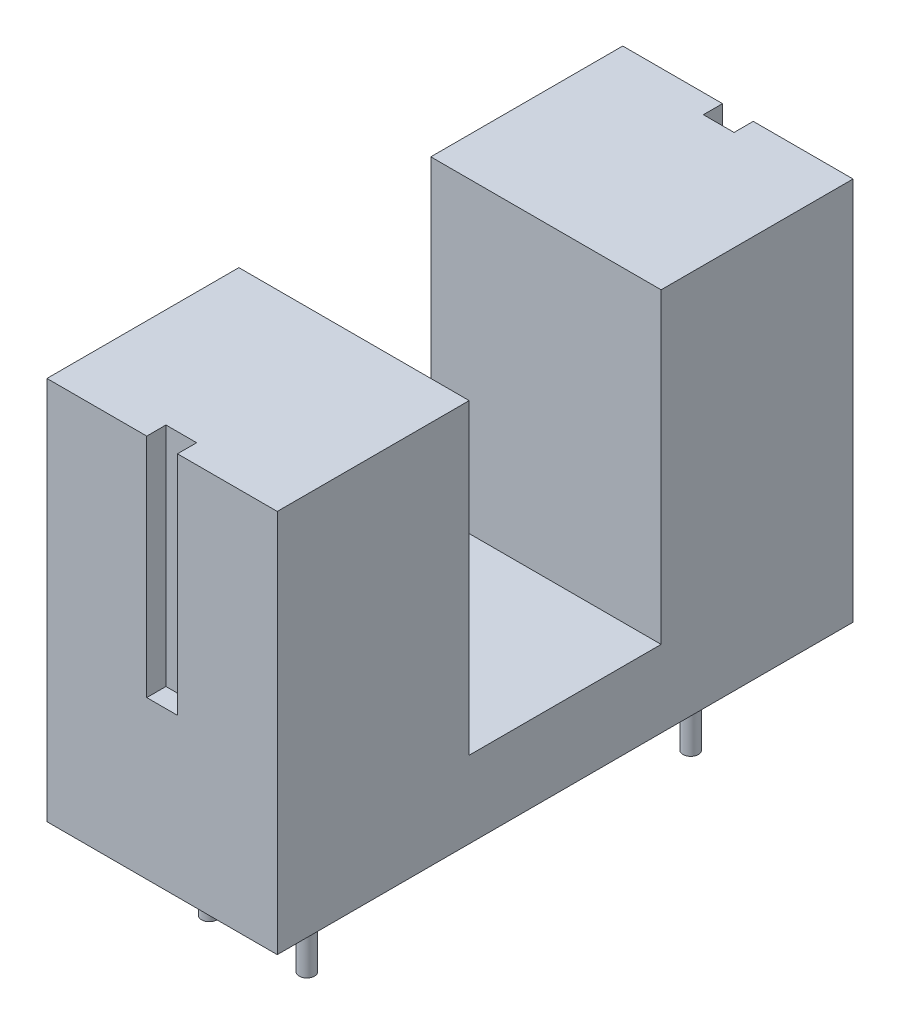
ISO-10303-21;
HEADER;
FILE_DESCRIPTION(('STEP AP214'),'2;1');
FILE_NAME('part.step','',(''),(''),'','','');
FILE_SCHEMA(('AUTOMOTIVE_DESIGN { 1 0 10303 214 1 1 1 1 }'));
ENDSEC;
DATA;
#1=APPLICATION_CONTEXT('core data for automotive mechanical design processes');
#2=APPLICATION_PROTOCOL_DEFINITION('international standard','automotive_design',2000,#1);
#3=PRODUCT_CONTEXT('',#1,'mechanical');
#4=PRODUCT('Part','Part','',(#3));
#5=PRODUCT_RELATED_PRODUCT_CATEGORY('part','',(#4));
#6=PRODUCT_DEFINITION_FORMATION('','',#4);
#7=PRODUCT_DEFINITION_CONTEXT('part definition',#1,'design');
#8=PRODUCT_DEFINITION('design','',#6,#7);
#9=PRODUCT_DEFINITION_SHAPE('','',#8);
#10=(LENGTH_UNIT() NAMED_UNIT(*) SI_UNIT(.MILLI.,.METRE.));
#11=(NAMED_UNIT(*) PLANE_ANGLE_UNIT() SI_UNIT($,.RADIAN.));
#12=(NAMED_UNIT(*) SI_UNIT($,.STERADIAN.) SOLID_ANGLE_UNIT());
#13=UNCERTAINTY_MEASURE_WITH_UNIT(LENGTH_MEASURE(1.E-05),#10,'distance_accuracy_value','');
#14=(GEOMETRIC_REPRESENTATION_CONTEXT(3) GLOBAL_UNCERTAINTY_ASSIGNED_CONTEXT((#13)) GLOBAL_UNIT_ASSIGNED_CONTEXT((#10,
#11,#12)) REPRESENTATION_CONTEXT('',''));
#15=CARTESIAN_POINT('',(0.,0.,0.));
#16=DIRECTION('',(0.,0.,1.));
#17=DIRECTION('',(1.,0.,0.));
#18=AXIS2_PLACEMENT_3D('',#15,#16,#17);
#19=CARTESIAN_POINT('',(6.,3.2,7.49999999999999));
#20=DIRECTION('',(0.,-1.,0.));
#21=DIRECTION('',(0.,0.,-1.));
#22=AXIS2_PLACEMENT_3D('',#19,#20,#21);
#23=PLANE('',#22);
#24=DIRECTION('',(0.,0.,1.));
#25=VECTOR('',#24,1.);
#26=CARTESIAN_POINT('',(3.4,3.2,7.00000000000002));
#27=LINE('',#26,#25);
#28=CARTESIAN_POINT('',(3.4,3.2,7.00000000000002));
#29=VERTEX_POINT('',#28);
#30=CARTESIAN_POINT('',(3.4,3.2,7.50000000000002));
#31=VERTEX_POINT('',#30);
#32=EDGE_CURVE('E153',#29,#31,#27,.T.);
#33=ORIENTED_EDGE('',*,*,#32,.T.);
#34=DIRECTION('',(-1.,0.,0.));
#35=VECTOR('',#34,1.);
#36=CARTESIAN_POINT('',(6.,3.2,7.49999999999999));
#37=LINE('',#36,#35);
#38=CARTESIAN_POINT('',(6.,3.2,7.49999999999999));
#39=VERTEX_POINT('',#38);
#40=EDGE_CURVE('E257',#39,#31,#37,.T.);
#41=ORIENTED_EDGE('',*,*,#40,.F.);
#42=DIRECTION('',(0.,0.,1.));
#43=VECTOR('',#42,1.);
#44=CARTESIAN_POINT('',(6.,3.2,7.49999999999999));
#45=LINE('',#44,#43);
#46=CARTESIAN_POINT('',(6.,3.2,2.49999999999999));
#47=VERTEX_POINT('',#46);
#48=EDGE_CURVE('E232',#47,#39,#45,.T.);
#49=ORIENTED_EDGE('',*,*,#48,.F.);
#50=DIRECTION('',(-1.,0.,0.));
#51=VECTOR('',#50,1.);
#52=CARTESIAN_POINT('',(6.,3.2,2.49999999999999));
#53=LINE('',#52,#51);
#54=CARTESIAN_POINT('',(0.,3.2,2.49999999999999));
#55=VERTEX_POINT('',#54);
#56=EDGE_CURVE('E259',#47,#55,#53,.T.);
#57=ORIENTED_EDGE('',*,*,#56,.T.);
#58=DIRECTION('',(0.,0.,1.));
#59=VECTOR('',#58,1.);
#60=CARTESIAN_POINT('',(0.,3.2,7.49999999999999));
#61=LINE('',#60,#59);
#62=CARTESIAN_POINT('',(0.,3.2,7.49999999999999));
#63=VERTEX_POINT('',#62);
#64=EDGE_CURVE('E250',#55,#63,#61,.T.);
#65=ORIENTED_EDGE('',*,*,#64,.T.);
#66=CARTESIAN_POINT('',(2.6,3.2,7.49999999999999));
#67=VERTEX_POINT('',#66);
#68=EDGE_CURVE('E256',#67,#63,#37,.T.);
#69=ORIENTED_EDGE('',*,*,#68,.F.);
#70=DIRECTION('',(0.,0.,1.));
#71=VECTOR('',#70,1.);
#72=CARTESIAN_POINT('',(2.6,3.2,7.00000000000002));
#73=LINE('',#72,#71);
#74=CARTESIAN_POINT('',(2.6,3.2,7.00000000000002));
#75=VERTEX_POINT('',#74);
#76=EDGE_CURVE('E52',#75,#67,#73,.T.);
#77=ORIENTED_EDGE('',*,*,#76,.F.);
#78=DIRECTION('',(1.,0.,0.));
#79=VECTOR('',#78,1.);
#80=CARTESIAN_POINT('',(3.4,3.2,7.00000000000002));
#81=LINE('',#80,#79);
#82=EDGE_CURVE('E171',#75,#29,#81,.T.);
#83=ORIENTED_EDGE('',*,*,#82,.T.);
#84=EDGE_LOOP('',(#33,#41,#49,#57,#65,#69,#77,#83));
#85=FACE_BOUND('',#84,.T.);
#86=ADVANCED_FACE('F37',(#85),#23,.F.);
#87=CARTESIAN_POINT('',(6.,-6.8,7.49999999999999));
#88=DIRECTION('',(0.,0.,-1.));
#89=DIRECTION('',(-1.,0.,0.));
#90=AXIS2_PLACEMENT_3D('',#87,#88,#89);
#91=PLANE('',#90);
#92=DIRECTION('',(0.,-1.,0.));
#93=VECTOR('',#92,1.);
#94=CARTESIAN_POINT('',(3.4,3.2,7.50000000000002));
#95=LINE('',#94,#93);
#96=CARTESIAN_POINT('',(3.4,-2.7,7.50000000000002));
#97=VERTEX_POINT('',#96);
#98=EDGE_CURVE('E160',#31,#97,#95,.T.);
#99=ORIENTED_EDGE('',*,*,#98,.T.);
#100=DIRECTION('',(-1.,0.,0.));
#101=VECTOR('',#100,1.);
#102=CARTESIAN_POINT('',(3.4,-2.7,7.50000000000002));
#103=LINE('',#102,#101);
#104=CARTESIAN_POINT('',(2.6,-2.7,7.50000000000002));
#105=VERTEX_POINT('',#104);
#106=EDGE_CURVE('E172',#97,#105,#103,.T.);
#107=ORIENTED_EDGE('',*,*,#106,.T.);
#108=DIRECTION('',(0.,1.,0.));
#109=VECTOR('',#108,1.);
#110=CARTESIAN_POINT('',(2.6,3.2,7.50000000000002));
#111=LINE('',#110,#109);
#112=EDGE_CURVE('E182',#105,#67,#111,.T.);
#113=ORIENTED_EDGE('',*,*,#112,.T.);
#114=ORIENTED_EDGE('',*,*,#68,.T.);
#115=DIRECTION('',(0.,-1.,0.));
#116=VECTOR('',#115,1.);
#117=CARTESIAN_POINT('',(0.,-6.8,7.49999999999999));
#118=LINE('',#117,#116);
#119=CARTESIAN_POINT('',(0.,-6.8,7.49999999999999));
#120=VERTEX_POINT('',#119);
#121=EDGE_CURVE('E222',#63,#120,#118,.T.);
#122=ORIENTED_EDGE('',*,*,#121,.T.);
#123=DIRECTION('',(-1.,0.,0.));
#124=VECTOR('',#123,1.);
#125=CARTESIAN_POINT('',(6.,-6.8,7.49999999999999));
#126=LINE('',#125,#124);
#127=CARTESIAN_POINT('',(6.,-6.8,7.49999999999999));
#128=VERTEX_POINT('',#127);
#129=EDGE_CURVE('E236',#128,#120,#126,.T.);
#130=ORIENTED_EDGE('',*,*,#129,.F.);
#131=DIRECTION('',(0.,-1.,0.));
#132=VECTOR('',#131,1.);
#133=CARTESIAN_POINT('',(6.,-6.8,7.49999999999999));
#134=LINE('',#133,#132);
#135=EDGE_CURVE('E234',#39,#128,#134,.T.);
#136=ORIENTED_EDGE('',*,*,#135,.F.);
#137=ORIENTED_EDGE('',*,*,#40,.T.);
#138=EDGE_LOOP('',(#99,#107,#113,#114,#122,#130,#136,#137));
#139=FACE_BOUND('',#138,.T.);
#140=ADVANCED_FACE('F291',(#139),#91,.F.);
#141=CARTESIAN_POINT('',(6.,-6.8,-7.50000000000002));
#142=DIRECTION('',(0.,1.,0.));
#143=DIRECTION('',(0.,0.,1.));
#144=AXIS2_PLACEMENT_3D('',#141,#142,#143);
#145=PLANE('',#144);
#146=CARTESIAN_POINT('',(1.73,-6.8,5.));
#147=DIRECTION('',(0.,1.,0.));
#148=DIRECTION('',(0.,0.,1.));
#149=AXIS2_PLACEMENT_3D('',#146,#147,#148);
#150=CIRCLE('',#149,0.2);
#151=CARTESIAN_POINT('',(1.73,-6.8,5.2));
#152=VERTEX_POINT('',#151);
#153=EDGE_CURVE('E11',#152,#152,#150,.F.);
#154=ORIENTED_EDGE('',*,*,#153,.F.);
#155=EDGE_LOOP('',(#154));
#156=FACE_BOUND('',#155,.T.);
#157=CARTESIAN_POINT('',(4.27,-6.8,5.));
#158=DIRECTION('',(0.,1.,0.));
#159=DIRECTION('',(0.,0.,1.));
#160=AXIS2_PLACEMENT_3D('',#157,#158,#159);
#161=CIRCLE('',#160,0.2);
#162=CARTESIAN_POINT('',(4.27,-6.8,5.2));
#163=VERTEX_POINT('',#162);
#164=EDGE_CURVE('E45',#163,#163,#161,.F.);
#165=ORIENTED_EDGE('',*,*,#164,.F.);
#166=EDGE_LOOP('',(#165));
#167=FACE_BOUND('',#166,.T.);
#168=CARTESIAN_POINT('',(4.27,-6.8,-5.));
#169=DIRECTION('',(0.,1.,0.));
#170=DIRECTION('',(0.,0.,1.));
#171=AXIS2_PLACEMENT_3D('',#168,#169,#170);
#172=CIRCLE('',#171,0.2);
#173=CARTESIAN_POINT('',(4.27,-6.8,-4.8));
#174=VERTEX_POINT('',#173);
#175=EDGE_CURVE('E281',#174,#174,#172,.F.);
#176=ORIENTED_EDGE('',*,*,#175,.F.);
#177=EDGE_LOOP('',(#176));
#178=FACE_BOUND('',#177,.T.);
#179=CARTESIAN_POINT('',(1.73,-6.8,-5.));
#180=DIRECTION('',(0.,1.,0.));
#181=DIRECTION('',(0.,0.,1.));
#182=AXIS2_PLACEMENT_3D('',#179,#180,#181);
#183=CIRCLE('',#182,0.2);
#184=CARTESIAN_POINT('',(1.73,-6.8,-4.8));
#185=VERTEX_POINT('',#184);
#186=EDGE_CURVE('E278',#185,#185,#183,.F.);
#187=ORIENTED_EDGE('',*,*,#186,.F.);
#188=EDGE_LOOP('',(#187));
#189=FACE_BOUND('',#188,.T.);
#190=DIRECTION('',(0.,0.,-1.));
#191=VECTOR('',#190,1.);
#192=CARTESIAN_POINT('',(0.,-6.8,-7.50000000000002));
#193=LINE('',#192,#191);
#194=CARTESIAN_POINT('',(0.,-6.8,-7.50000000000002));
#195=VERTEX_POINT('',#194);
#196=EDGE_CURVE('E211',#120,#195,#193,.T.);
#197=ORIENTED_EDGE('',*,*,#196,.T.);
#198=DIRECTION('',(-1.,0.,0.));
#199=VECTOR('',#198,1.);
#200=CARTESIAN_POINT('',(6.,-6.8,-7.50000000000002));
#201=LINE('',#200,#199);
#202=CARTESIAN_POINT('',(6.,-6.8,-7.50000000000002));
#203=VERTEX_POINT('',#202);
#204=EDGE_CURVE('E275',#203,#195,#201,.T.);
#205=ORIENTED_EDGE('',*,*,#204,.F.);
#206=DIRECTION('',(0.,0.,-1.));
#207=VECTOR('',#206,1.);
#208=CARTESIAN_POINT('',(6.,-6.8,-7.50000000000002));
#209=LINE('',#208,#207);
#210=EDGE_CURVE('E218',#128,#203,#209,.T.);
#211=ORIENTED_EDGE('',*,*,#210,.F.);
#212=ORIENTED_EDGE('',*,*,#129,.T.);
#213=EDGE_LOOP('',(#197,#205,#211,#212));
#214=FACE_BOUND('',#213,.T.);
#215=ADVANCED_FACE('F39',(#156,#167,#178,#189,#214),#145,.F.);
#216=CARTESIAN_POINT('',(6.,-6.8,-7.50000000000002));
#217=DIRECTION('',(0.,0.,1.));
#218=DIRECTION('',(1.,0.,0.));
#219=AXIS2_PLACEMENT_3D('',#216,#217,#218);
#220=PLANE('',#219);
#221=DIRECTION('',(-1.,0.,0.));
#222=VECTOR('',#221,1.);
#223=CARTESIAN_POINT('',(3.4,-2.7,-7.50000000000002));
#224=LINE('',#223,#222);
#225=CARTESIAN_POINT('',(3.4,-2.7,-7.50000000000002));
#226=VERTEX_POINT('',#225);
#227=CARTESIAN_POINT('',(2.6,-2.7,-7.50000000000002));
#228=VERTEX_POINT('',#227);
#229=EDGE_CURVE('E205',#226,#228,#224,.T.);
#230=ORIENTED_EDGE('',*,*,#229,.F.);
#231=DIRECTION('',(0.,-1.,0.));
#232=VECTOR('',#231,1.);
#233=CARTESIAN_POINT('',(3.4,3.2,-7.50000000000002));
#234=LINE('',#233,#232);
#235=CARTESIAN_POINT('',(3.4,3.2,-7.50000000000002));
#236=VERTEX_POINT('',#235);
#237=EDGE_CURVE('E189',#236,#226,#234,.T.);
#238=ORIENTED_EDGE('',*,*,#237,.F.);
#239=DIRECTION('',(-1.,0.,0.));
#240=VECTOR('',#239,1.);
#241=CARTESIAN_POINT('',(6.,3.2,-7.50000000000002));
#242=LINE('',#241,#240);
#243=CARTESIAN_POINT('',(6.,3.2,-7.50000000000002));
#244=VERTEX_POINT('',#243);
#245=EDGE_CURVE('E272',#244,#236,#242,.T.);
#246=ORIENTED_EDGE('',*,*,#245,.F.);
#247=DIRECTION('',(0.,1.,0.));
#248=VECTOR('',#247,1.);
#249=CARTESIAN_POINT('',(6.,-6.8,-7.50000000000002));
#250=LINE('',#249,#248);
#251=EDGE_CURVE('E221',#203,#244,#250,.T.);
#252=ORIENTED_EDGE('',*,*,#251,.F.);
#253=ORIENTED_EDGE('',*,*,#204,.T.);
#254=DIRECTION('',(0.,1.,0.));
#255=VECTOR('',#254,1.);
#256=CARTESIAN_POINT('',(0.,-6.8,-7.50000000000002));
#257=LINE('',#256,#255);
#258=CARTESIAN_POINT('',(0.,3.2,-7.50000000000002));
#259=VERTEX_POINT('',#258);
#260=EDGE_CURVE('E239',#195,#259,#257,.T.);
#261=ORIENTED_EDGE('',*,*,#260,.T.);
#262=CARTESIAN_POINT('',(2.6,3.2,-7.50000000000002));
#263=VERTEX_POINT('',#262);
#264=EDGE_CURVE('E271',#263,#259,#242,.T.);
#265=ORIENTED_EDGE('',*,*,#264,.F.);
#266=DIRECTION('',(0.,1.,0.));
#267=VECTOR('',#266,1.);
#268=CARTESIAN_POINT('',(2.6,3.2,-7.50000000000002));
#269=LINE('',#268,#267);
#270=EDGE_CURVE('E197',#228,#263,#269,.T.);
#271=ORIENTED_EDGE('',*,*,#270,.F.);
#272=EDGE_LOOP('',(#230,#238,#246,#252,#253,#261,#265,#271));
#273=FACE_BOUND('',#272,.T.);
#274=ADVANCED_FACE('F290',(#273),#220,.F.);
#275=CARTESIAN_POINT('',(6.,3.2,-7.50000000000002));
#276=DIRECTION('',(0.,-1.,0.));
#277=DIRECTION('',(0.,0.,-1.));
#278=AXIS2_PLACEMENT_3D('',#275,#276,#277);
#279=PLANE('',#278);
#280=ORIENTED_EDGE('',*,*,#245,.T.);
#281=DIRECTION('',(0.,0.,-1.));
#282=VECTOR('',#281,1.);
#283=CARTESIAN_POINT('',(3.4,3.2,-7.00000000000002));
#284=LINE('',#283,#282);
#285=CARTESIAN_POINT('',(3.4,3.2,-7.00000000000002));
#286=VERTEX_POINT('',#285);
#287=EDGE_CURVE('E209',#286,#236,#284,.T.);
#288=ORIENTED_EDGE('',*,*,#287,.F.);
#289=DIRECTION('',(1.,0.,0.));
#290=VECTOR('',#289,1.);
#291=CARTESIAN_POINT('',(3.4,3.2,-7.00000000000002));
#292=LINE('',#291,#290);
#293=CARTESIAN_POINT('',(2.6,3.2,-7.00000000000002));
#294=VERTEX_POINT('',#293);
#295=EDGE_CURVE('E200',#294,#286,#292,.T.);
#296=ORIENTED_EDGE('',*,*,#295,.F.);
#297=DIRECTION('',(0.,0.,-1.));
#298=VECTOR('',#297,1.);
#299=CARTESIAN_POINT('',(2.6,3.2,-7.00000000000002));
#300=LINE('',#299,#298);
#301=EDGE_CURVE('E212',#294,#263,#300,.T.);
#302=ORIENTED_EDGE('',*,*,#301,.T.);
#303=ORIENTED_EDGE('',*,*,#264,.T.);
#304=DIRECTION('',(0.,0.,1.));
#305=VECTOR('',#304,1.);
#306=CARTESIAN_POINT('',(0.,3.2,-7.50000000000002));
#307=LINE('',#306,#305);
#308=CARTESIAN_POINT('',(0.,3.2,-2.50000000000002));
#309=VERTEX_POINT('',#308);
#310=EDGE_CURVE('E242',#259,#309,#307,.T.);
#311=ORIENTED_EDGE('',*,*,#310,.T.);
#312=DIRECTION('',(-1.,0.,0.));
#313=VECTOR('',#312,1.);
#314=CARTESIAN_POINT('',(6.,3.2,-2.50000000000002));
#315=LINE('',#314,#313);
#316=CARTESIAN_POINT('',(6.,3.2,-2.50000000000002));
#317=VERTEX_POINT('',#316);
#318=EDGE_CURVE('E268',#317,#309,#315,.T.);
#319=ORIENTED_EDGE('',*,*,#318,.F.);
#320=DIRECTION('',(0.,0.,1.));
#321=VECTOR('',#320,1.);
#322=CARTESIAN_POINT('',(6.,3.2,-7.50000000000002));
#323=LINE('',#322,#321);
#324=EDGE_CURVE('E224',#244,#317,#323,.T.);
#325=ORIENTED_EDGE('',*,*,#324,.F.);
#326=EDGE_LOOP('',(#280,#288,#296,#302,#303,#311,#319,#325));
#327=FACE_BOUND('',#326,.T.);
#328=ADVANCED_FACE('F334',(#327),#279,.F.);
#329=CARTESIAN_POINT('',(6.,3.2,-2.50000000000002));
#330=DIRECTION('',(0.,0.,-1.));
#331=DIRECTION('',(0.,1.,0.));
#332=AXIS2_PLACEMENT_3D('',#329,#330,#331);
#333=PLANE('',#332);
#334=DIRECTION('',(0.,-1.,0.));
#335=VECTOR('',#334,1.);
#336=CARTESIAN_POINT('',(0.,3.2,-2.50000000000002));
#337=LINE('',#336,#335);
#338=CARTESIAN_POINT('',(0.,-4.8,-2.50000000000001));
#339=VERTEX_POINT('',#338);
#340=EDGE_CURVE('E244',#309,#339,#337,.T.);
#341=ORIENTED_EDGE('',*,*,#340,.T.);
#342=DIRECTION('',(-1.,0.,0.));
#343=VECTOR('',#342,1.);
#344=CARTESIAN_POINT('',(6.,-4.8,-2.50000000000001));
#345=LINE('',#344,#343);
#346=CARTESIAN_POINT('',(6.,-4.8,-2.50000000000001));
#347=VERTEX_POINT('',#346);
#348=EDGE_CURVE('E265',#347,#339,#345,.T.);
#349=ORIENTED_EDGE('',*,*,#348,.F.);
#350=DIRECTION('',(0.,-1.,0.));
#351=VECTOR('',#350,1.);
#352=CARTESIAN_POINT('',(6.,3.2,-2.50000000000002));
#353=LINE('',#352,#351);
#354=EDGE_CURVE('E226',#317,#347,#353,.T.);
#355=ORIENTED_EDGE('',*,*,#354,.F.);
#356=ORIENTED_EDGE('',*,*,#318,.T.);
#357=EDGE_LOOP('',(#341,#349,#355,#356));
#358=FACE_BOUND('',#357,.T.);
#359=ADVANCED_FACE('F331',(#358),#333,.F.);
#360=CARTESIAN_POINT('',(6.,-4.8,2.49999999999999));
#361=DIRECTION('',(0.,-1.,0.));
#362=DIRECTION('',(0.,0.,-1.));
#363=AXIS2_PLACEMENT_3D('',#360,#361,#362);
#364=PLANE('',#363);
#365=DIRECTION('',(0.,0.,1.));
#366=VECTOR('',#365,1.);
#367=CARTESIAN_POINT('',(0.,-4.8,2.49999999999999));
#368=LINE('',#367,#366);
#369=CARTESIAN_POINT('',(0.,-4.8,2.49999999999999));
#370=VERTEX_POINT('',#369);
#371=EDGE_CURVE('E246',#339,#370,#368,.T.);
#372=ORIENTED_EDGE('',*,*,#371,.T.);
#373=DIRECTION('',(-1.,0.,0.));
#374=VECTOR('',#373,1.);
#375=CARTESIAN_POINT('',(6.,-4.8,2.49999999999999));
#376=LINE('',#375,#374);
#377=CARTESIAN_POINT('',(6.,-4.8,2.49999999999999));
#378=VERTEX_POINT('',#377);
#379=EDGE_CURVE('E262',#378,#370,#376,.T.);
#380=ORIENTED_EDGE('',*,*,#379,.F.);
#381=DIRECTION('',(0.,0.,1.));
#382=VECTOR('',#381,1.);
#383=CARTESIAN_POINT('',(6.,-4.8,2.49999999999999));
#384=LINE('',#383,#382);
#385=EDGE_CURVE('E228',#347,#378,#384,.T.);
#386=ORIENTED_EDGE('',*,*,#385,.F.);
#387=ORIENTED_EDGE('',*,*,#348,.T.);
#388=EDGE_LOOP('',(#372,#380,#386,#387));
#389=FACE_BOUND('',#388,.T.);
#390=ADVANCED_FACE('F327',(#389),#364,.F.);
#391=CARTESIAN_POINT('',(6.,3.2,2.49999999999999));
#392=DIRECTION('',(0.,0.,1.));
#393=DIRECTION('',(1.,0.,0.));
#394=AXIS2_PLACEMENT_3D('',#391,#392,#393);
#395=PLANE('',#394);
#396=DIRECTION('',(0.,1.,0.));
#397=VECTOR('',#396,1.);
#398=CARTESIAN_POINT('',(0.,3.2,2.49999999999999));
#399=LINE('',#398,#397);
#400=EDGE_CURVE('E248',#370,#55,#399,.T.);
#401=ORIENTED_EDGE('',*,*,#400,.T.);
#402=ORIENTED_EDGE('',*,*,#56,.F.);
#403=DIRECTION('',(0.,1.,0.));
#404=VECTOR('',#403,1.);
#405=CARTESIAN_POINT('',(6.,3.2,2.49999999999999));
#406=LINE('',#405,#404);
#407=EDGE_CURVE('E230',#378,#47,#406,.T.);
#408=ORIENTED_EDGE('',*,*,#407,.F.);
#409=ORIENTED_EDGE('',*,*,#379,.T.);
#410=EDGE_LOOP('',(#401,#402,#408,#409));
#411=FACE_BOUND('',#410,.T.);
#412=ADVANCED_FACE('F322',(#411),#395,.F.);
#413=CARTESIAN_POINT('',(6.,0.,0.));
#414=DIRECTION('',(-1.,0.,0.));
#415=DIRECTION('',(0.,0.,1.));
#416=AXIS2_PLACEMENT_3D('',#413,#414,#415);
#417=PLANE('',#416);
#418=ORIENTED_EDGE('',*,*,#210,.T.);
#419=ORIENTED_EDGE('',*,*,#251,.T.);
#420=ORIENTED_EDGE('',*,*,#324,.T.);
#421=ORIENTED_EDGE('',*,*,#354,.T.);
#422=ORIENTED_EDGE('',*,*,#385,.T.);
#423=ORIENTED_EDGE('',*,*,#407,.T.);
#424=ORIENTED_EDGE('',*,*,#48,.T.);
#425=ORIENTED_EDGE('',*,*,#135,.T.);
#426=EDGE_LOOP('',(#418,#419,#420,#421,#422,#423,#424,#425));
#427=FACE_BOUND('',#426,.T.);
#428=ADVANCED_FACE('F314',(#427),#417,.F.);
#429=CARTESIAN_POINT('',(0.,0.,0.));
#430=DIRECTION('',(-1.,0.,0.));
#431=DIRECTION('',(0.,0.,1.));
#432=AXIS2_PLACEMENT_3D('',#429,#430,#431);
#433=PLANE('',#432);
#434=ORIENTED_EDGE('',*,*,#196,.F.);
#435=ORIENTED_EDGE('',*,*,#121,.F.);
#436=ORIENTED_EDGE('',*,*,#64,.F.);
#437=ORIENTED_EDGE('',*,*,#400,.F.);
#438=ORIENTED_EDGE('',*,*,#371,.F.);
#439=ORIENTED_EDGE('',*,*,#340,.F.);
#440=ORIENTED_EDGE('',*,*,#310,.F.);
#441=ORIENTED_EDGE('',*,*,#260,.F.);
#442=EDGE_LOOP('',(#434,#435,#436,#437,#438,#439,#440,#441));
#443=FACE_BOUND('',#442,.T.);
#444=ADVANCED_FACE('F303',(#443),#433,.T.);
#445=CARTESIAN_POINT('',(3.4,3.2,-7.00000000000002));
#446=DIRECTION('',(1.,0.,0.));
#447=DIRECTION('',(0.,1.,0.));
#448=AXIS2_PLACEMENT_3D('',#445,#446,#447);
#449=PLANE('',#448);
#450=ORIENTED_EDGE('',*,*,#237,.T.);
#451=DIRECTION('',(0.,0.,-1.));
#452=VECTOR('',#451,1.);
#453=CARTESIAN_POINT('',(3.4,-2.7,-7.00000000000002));
#454=LINE('',#453,#452);
#455=CARTESIAN_POINT('',(3.4,-2.7,-7.00000000000002));
#456=VERTEX_POINT('',#455);
#457=EDGE_CURVE('E202',#456,#226,#454,.T.);
#458=ORIENTED_EDGE('',*,*,#457,.F.);
#459=DIRECTION('',(0.,-1.,0.));
#460=VECTOR('',#459,1.);
#461=CARTESIAN_POINT('',(3.4,3.2,-7.00000000000002));
#462=LINE('',#461,#460);
#463=EDGE_CURVE('E193',#286,#456,#462,.T.);
#464=ORIENTED_EDGE('',*,*,#463,.F.);
#465=ORIENTED_EDGE('',*,*,#287,.T.);
#466=EDGE_LOOP('',(#450,#458,#464,#465));
#467=FACE_BOUND('',#466,.T.);
#468=ADVANCED_FACE('F343',(#467),#449,.F.);
#469=CARTESIAN_POINT('',(2.6,3.2,-7.00000000000002));
#470=DIRECTION('',(-1.,0.,0.));
#471=DIRECTION('',(0.,-1.,0.));
#472=AXIS2_PLACEMENT_3D('',#469,#470,#471);
#473=PLANE('',#472);
#474=ORIENTED_EDGE('',*,*,#270,.T.);
#475=ORIENTED_EDGE('',*,*,#301,.F.);
#476=DIRECTION('',(0.,1.,0.));
#477=VECTOR('',#476,1.);
#478=CARTESIAN_POINT('',(2.6,3.2,-7.00000000000002));
#479=LINE('',#478,#477);
#480=CARTESIAN_POINT('',(2.6,-2.7,-7.00000000000002));
#481=VERTEX_POINT('',#480);
#482=EDGE_CURVE('E60',#481,#294,#479,.T.);
#483=ORIENTED_EDGE('',*,*,#482,.F.);
#484=DIRECTION('',(0.,0.,-1.));
#485=VECTOR('',#484,1.);
#486=CARTESIAN_POINT('',(2.6,-2.7,-7.00000000000002));
#487=LINE('',#486,#485);
#488=EDGE_CURVE('E215',#481,#228,#487,.T.);
#489=ORIENTED_EDGE('',*,*,#488,.T.);
#490=EDGE_LOOP('',(#474,#475,#483,#489));
#491=FACE_BOUND('',#490,.T.);
#492=ADVANCED_FACE('F338',(#491),#473,.F.);
#493=CARTESIAN_POINT('',(3.4,-2.7,-7.00000000000002));
#494=DIRECTION('',(0.,-1.,0.));
#495=DIRECTION('',(0.,0.,-1.));
#496=AXIS2_PLACEMENT_3D('',#493,#494,#495);
#497=PLANE('',#496);
#498=ORIENTED_EDGE('',*,*,#229,.T.);
#499=ORIENTED_EDGE('',*,*,#488,.F.);
#500=DIRECTION('',(-1.,0.,0.));
#501=VECTOR('',#500,1.);
#502=CARTESIAN_POINT('',(3.4,-2.7,-7.00000000000002));
#503=LINE('',#502,#501);
#504=EDGE_CURVE('E196',#456,#481,#503,.T.);
#505=ORIENTED_EDGE('',*,*,#504,.F.);
#506=ORIENTED_EDGE('',*,*,#457,.T.);
#507=EDGE_LOOP('',(#498,#499,#505,#506));
#508=FACE_BOUND('',#507,.T.);
#509=ADVANCED_FACE('F341',(#508),#497,.F.);
#510=CARTESIAN_POINT('',(0.,0.,-7.00000000000002));
#511=DIRECTION('',(0.,0.,-1.));
#512=DIRECTION('',(-1.,0.,0.));
#513=AXIS2_PLACEMENT_3D('',#510,#511,#512);
#514=PLANE('',#513);
#515=ORIENTED_EDGE('',*,*,#463,.T.);
#516=ORIENTED_EDGE('',*,*,#504,.T.);
#517=ORIENTED_EDGE('',*,*,#482,.T.);
#518=ORIENTED_EDGE('',*,*,#295,.T.);
#519=EDGE_LOOP('',(#515,#516,#517,#518));
#520=FACE_BOUND('',#519,.T.);
#521=ADVANCED_FACE('F345',(#520),#514,.T.);
#522=CARTESIAN_POINT('',(3.4,3.2,7.00000000000002));
#523=DIRECTION('',(-1.,0.,0.));
#524=DIRECTION('',(0.,-1.,0.));
#525=AXIS2_PLACEMENT_3D('',#522,#523,#524);
#526=PLANE('',#525);
#527=ORIENTED_EDGE('',*,*,#98,.F.);
#528=ORIENTED_EDGE('',*,*,#32,.F.);
#529=DIRECTION('',(0.,-1.,0.));
#530=VECTOR('',#529,1.);
#531=CARTESIAN_POINT('',(3.4,3.2,7.00000000000002));
#532=LINE('',#531,#530);
#533=CARTESIAN_POINT('',(3.4,-2.7,7.00000000000002));
#534=VERTEX_POINT('',#533);
#535=EDGE_CURVE('E157',#29,#534,#532,.T.);
#536=ORIENTED_EDGE('',*,*,#535,.T.);
#537=DIRECTION('',(0.,0.,1.));
#538=VECTOR('',#537,1.);
#539=CARTESIAN_POINT('',(3.4,-2.7,7.00000000000002));
#540=LINE('',#539,#538);
#541=EDGE_CURVE('E187',#534,#97,#540,.T.);
#542=ORIENTED_EDGE('',*,*,#541,.T.);
#543=EDGE_LOOP('',(#527,#528,#536,#542));
#544=FACE_BOUND('',#543,.T.);
#545=ADVANCED_FACE('F155',(#544),#526,.T.);
#546=CARTESIAN_POINT('',(3.4,-2.7,7.00000000000002));
#547=DIRECTION('',(0.,1.,0.));
#548=DIRECTION('',(0.,0.,1.));
#549=AXIS2_PLACEMENT_3D('',#546,#547,#548);
#550=PLANE('',#549);
#551=ORIENTED_EDGE('',*,*,#106,.F.);
#552=ORIENTED_EDGE('',*,*,#541,.F.);
#553=DIRECTION('',(-1.,0.,0.));
#554=VECTOR('',#553,1.);
#555=CARTESIAN_POINT('',(3.4,-2.7,7.00000000000002));
#556=LINE('',#555,#554);
#557=CARTESIAN_POINT('',(2.6,-2.7,7.00000000000002));
#558=VERTEX_POINT('',#557);
#559=EDGE_CURVE('E165',#534,#558,#556,.T.);
#560=ORIENTED_EDGE('',*,*,#559,.T.);
#561=DIRECTION('',(0.,0.,1.));
#562=VECTOR('',#561,1.);
#563=CARTESIAN_POINT('',(2.6,-2.7,7.00000000000002));
#564=LINE('',#563,#562);
#565=EDGE_CURVE('E190',#558,#105,#564,.T.);
#566=ORIENTED_EDGE('',*,*,#565,.T.);
#567=EDGE_LOOP('',(#551,#552,#560,#566));
#568=FACE_BOUND('',#567,.T.);
#569=ADVANCED_FACE('F352',(#568),#550,.T.);
#570=CARTESIAN_POINT('',(2.6,3.2,7.00000000000002));
#571=DIRECTION('',(1.,0.,0.));
#572=DIRECTION('',(0.,1.,0.));
#573=AXIS2_PLACEMENT_3D('',#570,#571,#572);
#574=PLANE('',#573);
#575=ORIENTED_EDGE('',*,*,#112,.F.);
#576=ORIENTED_EDGE('',*,*,#565,.F.);
#577=DIRECTION('',(0.,1.,0.));
#578=VECTOR('',#577,1.);
#579=CARTESIAN_POINT('',(2.6,3.2,7.00000000000002));
#580=LINE('',#579,#578);
#581=EDGE_CURVE('E175',#558,#75,#580,.T.);
#582=ORIENTED_EDGE('',*,*,#581,.T.);
#583=ORIENTED_EDGE('',*,*,#76,.T.);
#584=EDGE_LOOP('',(#575,#576,#582,#583));
#585=FACE_BOUND('',#584,.T.);
#586=ADVANCED_FACE('F457',(#585),#574,.T.);
#587=CARTESIAN_POINT('',(0.,0.,7.00000000000002));
#588=DIRECTION('',(0.,0.,1.));
#589=DIRECTION('',(-1.,0.,0.));
#590=AXIS2_PLACEMENT_3D('',#587,#588,#589);
#591=PLANE('',#590);
#592=ORIENTED_EDGE('',*,*,#535,.F.);
#593=ORIENTED_EDGE('',*,*,#82,.F.);
#594=ORIENTED_EDGE('',*,*,#581,.F.);
#595=ORIENTED_EDGE('',*,*,#559,.F.);
#596=EDGE_LOOP('',(#592,#593,#594,#595));
#597=FACE_BOUND('',#596,.T.);
#598=ADVANCED_FACE('F169',(#597),#591,.T.);
#599=CARTESIAN_POINT('',(1.73,-9.3,-5.));
#600=DIRECTION('',(0.,1.,0.));
#601=DIRECTION('',(0.,0.,1.));
#602=AXIS2_PLACEMENT_3D('',#599,#600,#601);
#603=CYLINDRICAL_SURFACE('',#602,0.2);
#604=CARTESIAN_POINT('',(1.73,-9.3,-5.));
#605=DIRECTION('',(0.,-1.,0.));
#606=DIRECTION('',(0.,0.,-1.));
#607=AXIS2_PLACEMENT_3D('',#604,#605,#606);
#608=CIRCLE('',#607,0.2);
#609=CARTESIAN_POINT('',(1.73,-9.3,-5.2));
#610=VERTEX_POINT('',#609);
#611=EDGE_CURVE('E183',#610,#610,#608,.T.);
#612=ORIENTED_EDGE('',*,*,#611,.F.);
#613=EDGE_LOOP('',(#612));
#614=FACE_BOUND('',#613,.T.);
#615=ORIENTED_EDGE('',*,*,#186,.T.);
#616=EDGE_LOOP('',(#615));
#617=FACE_BOUND('',#616,.T.);
#618=ADVANCED_FACE('F475',(#614,#617),#603,.T.);
#619=CARTESIAN_POINT('',(1.73,-9.3,-5.));
#620=DIRECTION('',(0.,-1.,0.));
#621=DIRECTION('',(0.,0.,-1.));
#622=AXIS2_PLACEMENT_3D('',#619,#620,#621);
#623=PLANE('',#622);
#624=ORIENTED_EDGE('',*,*,#611,.T.);
#625=EDGE_LOOP('',(#624));
#626=FACE_BOUND('',#625,.T.);
#627=ADVANCED_FACE('F492',(#626),#623,.T.);
#628=CARTESIAN_POINT('',(4.27,-9.3,-5.));
#629=DIRECTION('',(0.,1.,0.));
#630=DIRECTION('',(0.,0.,1.));
#631=AXIS2_PLACEMENT_3D('',#628,#629,#630);
#632=CYLINDRICAL_SURFACE('',#631,0.2);
#633=CARTESIAN_POINT('',(4.27,-9.3,-5.));
#634=DIRECTION('',(0.,-1.,0.));
#635=DIRECTION('',(0.,0.,1.));
#636=AXIS2_PLACEMENT_3D('',#633,#634,#635);
#637=CIRCLE('',#636,0.2);
#638=CARTESIAN_POINT('',(4.27,-9.3,-4.8));
#639=VERTEX_POINT('',#638);
#640=EDGE_CURVE('E589',#639,#639,#637,.T.);
#641=ORIENTED_EDGE('',*,*,#640,.F.);
#642=EDGE_LOOP('',(#641));
#643=FACE_BOUND('',#642,.T.);
#644=ORIENTED_EDGE('',*,*,#175,.T.);
#645=EDGE_LOOP('',(#644));
#646=FACE_BOUND('',#645,.T.);
#647=ADVANCED_FACE('F505',(#643,#646),#632,.T.);
#648=CARTESIAN_POINT('',(4.27,-9.3,-5.));
#649=DIRECTION('',(0.,1.,0.));
#650=DIRECTION('',(0.,0.,1.));
#651=AXIS2_PLACEMENT_3D('',#648,#649,#650);
#652=PLANE('',#651);
#653=ORIENTED_EDGE('',*,*,#640,.T.);
#654=EDGE_LOOP('',(#653));
#655=FACE_BOUND('',#654,.T.);
#656=ADVANCED_FACE('F517',(#655),#652,.F.);
#657=CARTESIAN_POINT('',(4.27,-9.3,5.));
#658=DIRECTION('',(0.,1.,0.));
#659=DIRECTION('',(0.,0.,1.));
#660=AXIS2_PLACEMENT_3D('',#657,#658,#659);
#661=CYLINDRICAL_SURFACE('',#660,0.2);
#662=CARTESIAN_POINT('',(4.27,-9.3,5.));
#663=DIRECTION('',(0.,-1.,0.));
#664=DIRECTION('',(0.,0.,-1.));
#665=AXIS2_PLACEMENT_3D('',#662,#663,#664);
#666=CIRCLE('',#665,0.2);
#667=CARTESIAN_POINT('',(4.27,-9.3,4.8));
#668=VERTEX_POINT('',#667);
#669=EDGE_CURVE('E586',#668,#668,#666,.T.);
#670=ORIENTED_EDGE('',*,*,#669,.F.);
#671=EDGE_LOOP('',(#670));
#672=FACE_BOUND('',#671,.T.);
#673=ORIENTED_EDGE('',*,*,#164,.T.);
#674=EDGE_LOOP('',(#673));
#675=FACE_BOUND('',#674,.T.);
#676=ADVANCED_FACE('F286',(#672,#675),#661,.T.);
#677=CARTESIAN_POINT('',(4.27,-9.3,5.));
#678=DIRECTION('',(0.,-1.,0.));
#679=DIRECTION('',(0.,0.,-1.));
#680=AXIS2_PLACEMENT_3D('',#677,#678,#679);
#681=PLANE('',#680);
#682=ORIENTED_EDGE('',*,*,#669,.T.);
#683=EDGE_LOOP('',(#682));
#684=FACE_BOUND('',#683,.T.);
#685=ADVANCED_FACE('F536',(#684),#681,.T.);
#686=CARTESIAN_POINT('',(1.73,-9.3,5.));
#687=DIRECTION('',(0.,1.,0.));
#688=DIRECTION('',(0.,0.,1.));
#689=AXIS2_PLACEMENT_3D('',#686,#687,#688);
#690=CYLINDRICAL_SURFACE('',#689,0.2);
#691=CARTESIAN_POINT('',(1.73,-9.3,5.));
#692=DIRECTION('',(0.,-1.,0.));
#693=DIRECTION('',(0.,0.,1.));
#694=AXIS2_PLACEMENT_3D('',#691,#692,#693);
#695=CIRCLE('',#694,0.2);
#696=CARTESIAN_POINT('',(1.73,-9.3,5.2));
#697=VERTEX_POINT('',#696);
#698=EDGE_CURVE('E585',#697,#697,#695,.T.);
#699=ORIENTED_EDGE('',*,*,#698,.F.);
#700=EDGE_LOOP('',(#699));
#701=FACE_BOUND('',#700,.T.);
#702=ORIENTED_EDGE('',*,*,#153,.T.);
#703=EDGE_LOOP('',(#702));
#704=FACE_BOUND('',#703,.T.);
#705=ADVANCED_FACE('F547',(#701,#704),#690,.T.);
#706=CARTESIAN_POINT('',(1.73,-9.3,5.));
#707=DIRECTION('',(0.,1.,0.));
#708=DIRECTION('',(0.,0.,1.));
#709=AXIS2_PLACEMENT_3D('',#706,#707,#708);
#710=PLANE('',#709);
#711=ORIENTED_EDGE('',*,*,#698,.T.);
#712=EDGE_LOOP('',(#711));
#713=FACE_BOUND('',#712,.T.);
#714=ADVANCED_FACE('F557',(#713),#710,.F.);
#715=CLOSED_SHELL('',(#86,#140,#215,#274,#328,#359,#390,#412,#428,#444,#468,#492,#509,#521,#545,
#569,#586,#598,#618,#627,#647,#656,#676,#685,#705,#714));
#716=MANIFOLD_SOLID_BREP('B2',#715);
#717=ADVANCED_BREP_SHAPE_REPRESENTATION('',(#18,#716),#14);
#718=SHAPE_DEFINITION_REPRESENTATION(#9,#717);
ENDSEC;
END-ISO-10303-21;
